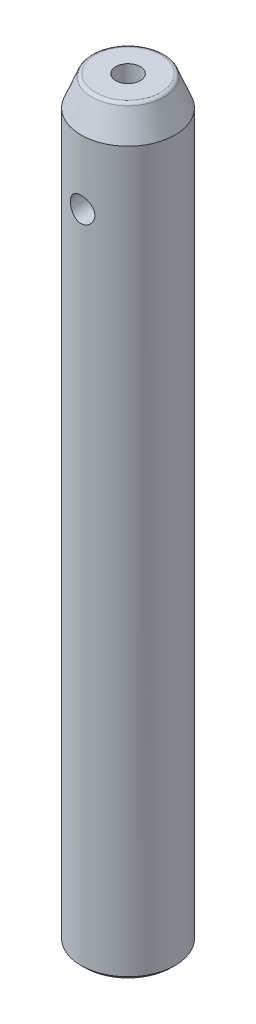
ISO-10303-21;
HEADER;
FILE_DESCRIPTION(('STEP AP214'),'2;1');
FILE_NAME('part.step','',(''),(''),'','','');
FILE_SCHEMA(('AUTOMOTIVE_DESIGN { 1 0 10303 214 1 1 1 1 }'));
ENDSEC;
DATA;
#1=APPLICATION_CONTEXT('core data for automotive mechanical design processes');
#2=APPLICATION_PROTOCOL_DEFINITION('international standard','automotive_design',2000,#1);
#3=PRODUCT_CONTEXT('',#1,'mechanical');
#4=PRODUCT('Part','Part','',(#3));
#5=PRODUCT_RELATED_PRODUCT_CATEGORY('part','',(#4));
#6=PRODUCT_DEFINITION_FORMATION('','',#4);
#7=PRODUCT_DEFINITION_CONTEXT('part definition',#1,'design');
#8=PRODUCT_DEFINITION('design','',#6,#7);
#9=PRODUCT_DEFINITION_SHAPE('','',#8);
#10=(LENGTH_UNIT() NAMED_UNIT(*) SI_UNIT(.MILLI.,.METRE.));
#11=(NAMED_UNIT(*) PLANE_ANGLE_UNIT() SI_UNIT($,.RADIAN.));
#12=(NAMED_UNIT(*) SI_UNIT($,.STERADIAN.) SOLID_ANGLE_UNIT());
#13=UNCERTAINTY_MEASURE_WITH_UNIT(LENGTH_MEASURE(1.E-05),#10,'distance_accuracy_value','');
#14=(GEOMETRIC_REPRESENTATION_CONTEXT(3) GLOBAL_UNCERTAINTY_ASSIGNED_CONTEXT((#13)) GLOBAL_UNIT_ASSIGNED_CONTEXT((#10,
#11,#12)) REPRESENTATION_CONTEXT('',''));
#15=CARTESIAN_POINT('',(0.,0.,0.));
#16=DIRECTION('',(0.,0.,1.));
#17=DIRECTION('',(1.,0.,0.));
#18=AXIS2_PLACEMENT_3D('',#15,#16,#17);
#19=CARTESIAN_POINT('',(0.,11.0000000000241,0.));
#20=DIRECTION('',(0.,-1.,0.));
#21=DIRECTION('',(0.,0.,-1.));
#22=AXIS2_PLACEMENT_3D('',#19,#20,#21);
#23=CONICAL_SURFACE('',#22,2.49999999999773,1.02974425868524);
#24=CARTESIAN_POINT('',(0.,12.5021515474941,-1.13686837721616E-10));
#25=VERTEX_POINT('',#24);
#26=VERTEX_LOOP('',#25);
#27=FACE_BOUND('',#26,.T.);
#28=CARTESIAN_POINT('',(0.,11.,0.));
#29=DIRECTION('',(0.,-1.,0.));
#30=DIRECTION('',(0.,0.,-1.));
#31=AXIS2_PLACEMENT_3D('',#28,#29,#30);
#32=CIRCLE('',#31,2.5);
#33=CARTESIAN_POINT('',(0.,11.,-2.5));
#34=VERTEX_POINT('',#33);
#35=EDGE_CURVE('E33',#34,#34,#32,.T.);
#36=ORIENTED_EDGE('',*,*,#35,.T.);
#37=EDGE_LOOP('',(#36));
#38=FACE_BOUND('',#37,.T.);
#39=ADVANCED_FACE('F17',(#27,#38),#23,.F.);
#40=CARTESIAN_POINT('',(0.,101.6,0.));
#41=DIRECTION('',(0.,1.,0.));
#42=DIRECTION('',(0.,0.,1.));
#43=AXIS2_PLACEMENT_3D('',#40,#41,#42);
#44=CYLINDRICAL_SURFACE('',#43,1.65);
#45=CARTESIAN_POINT('',(0.,101.6,0.));
#46=DIRECTION('',(0.,1.,0.));
#47=DIRECTION('',(0.,0.,1.));
#48=AXIS2_PLACEMENT_3D('',#45,#46,#47);
#49=CIRCLE('',#48,1.65);
#50=CARTESIAN_POINT('',(0.,101.6,1.65));
#51=VERTEX_POINT('',#50);
#52=EDGE_CURVE('E20',#51,#51,#49,.F.);
#53=ORIENTED_EDGE('',*,*,#52,.F.);
#54=EDGE_LOOP('',(#53));
#55=FACE_BOUND('',#54,.T.);
#56=CARTESIAN_POINT('',(0.,91.4999999999964,0.));
#57=DIRECTION('',(0.,1.,0.));
#58=DIRECTION('',(0.,0.,1.));
#59=AXIS2_PLACEMENT_3D('',#56,#57,#58);
#60=CIRCLE('',#59,1.64999999998372);
#61=CARTESIAN_POINT('',(0.,91.4999999999964,1.64999999998372));
#62=VERTEX_POINT('',#61);
#63=EDGE_CURVE('E37',#62,#62,#60,.F.);
#64=ORIENTED_EDGE('',*,*,#63,.T.);
#65=EDGE_LOOP('',(#64));
#66=FACE_BOUND('',#65,.T.);
#67=ADVANCED_FACE('F30',(#55,#66),#44,.F.);
#68=CARTESIAN_POINT('',(0.,0.,0.));
#69=DIRECTION('',(0.,-1.,0.));
#70=DIRECTION('',(0.,0.,-1.));
#71=AXIS2_PLACEMENT_3D('',#68,#69,#70);
#72=CYLINDRICAL_SURFACE('',#71,2.5);
#73=CARTESIAN_POINT('',(0.,0.,0.));
#74=DIRECTION('',(0.,-1.,0.));
#75=DIRECTION('',(0.,0.,-1.));
#76=AXIS2_PLACEMENT_3D('',#73,#74,#75);
#77=CIRCLE('',#76,2.5);
#78=CARTESIAN_POINT('',(0.,0.,-2.5));
#79=VERTEX_POINT('',#78);
#80=EDGE_CURVE('E95',#79,#79,#77,.T.);
#81=ORIENTED_EDGE('',*,*,#80,.T.);
#82=EDGE_LOOP('',(#81));
#83=FACE_BOUND('',#82,.T.);
#84=ORIENTED_EDGE('',*,*,#35,.F.);
#85=EDGE_LOOP('',(#84));
#86=FACE_BOUND('',#85,.T.);
#87=ADVANCED_FACE('F107',(#83,#86),#72,.F.);
#88=CARTESIAN_POINT('',(0.,101.6,0.));
#89=DIRECTION('',(0.,1.,0.));
#90=DIRECTION('',(0.,0.,1.));
#91=AXIS2_PLACEMENT_3D('',#88,#89,#90);
#92=PLANE('',#91);
#93=ORIENTED_EDGE('',*,*,#52,.T.);
#94=EDGE_LOOP('',(#93));
#95=FACE_BOUND('',#94,.T.);
#96=CARTESIAN_POINT('',(0.,101.6,0.));
#97=DIRECTION('',(0.,-1.,0.));
#98=DIRECTION('',(0.,0.,1.));
#99=AXIS2_PLACEMENT_3D('',#96,#97,#98);
#100=CIRCLE('',#99,4.41148351928655);
#101=CARTESIAN_POINT('',(0.,101.6,4.41148351928655));
#102=VERTEX_POINT('',#101);
#103=EDGE_CURVE('E90',#102,#102,#100,.T.);
#104=ORIENTED_EDGE('',*,*,#103,.F.);
#105=EDGE_LOOP('',(#104));
#106=FACE_BOUND('',#105,.T.);
#107=ADVANCED_FACE('F102',(#95,#106),#92,.T.);
#108=CARTESIAN_POINT('',(0.,91.4999999999964,0.));
#109=DIRECTION('',(0.,1.,0.));
#110=DIRECTION('',(0.,0.,1.));
#111=AXIS2_PLACEMENT_3D('',#108,#109,#110);
#112=CONICAL_SURFACE('',#111,1.64999999998372,1.0297442586974);
#113=ORIENTED_EDGE('',*,*,#63,.F.);
#114=EDGE_LOOP('',(#113));
#115=FACE_BOUND('',#114,.T.);
#116=CARTESIAN_POINT('',(-0.0573261511498962,90.5490038545711,-0.0352116028222918));
#117=CARTESIAN_POINT('',(-0.0554022883732764,90.5490707375836,-0.0385561163580597));
#118=CARTESIAN_POINT('',(-0.0531981532231132,90.5491440256648,-0.0417422648619109));
#119=CARTESIAN_POINT('',(-0.0482828474830664,90.5492952426134,-0.0477003560094668));
#120=CARTESIAN_POINT('',(-0.0455711766414923,90.5493731760074,-0.0504718850927817));
#121=CARTESIAN_POINT('',(-0.0397197199490266,90.5495244373034,-0.0555035597035168));
#122=CARTESIAN_POINT('',(-0.0365810372641078,90.549597776384,-0.0577649843052197));
#123=CARTESIAN_POINT('',(-0.0299586933559447,90.5497313166698,-0.0617075438777838));
#124=CARTESIAN_POINT('',(-0.0264751554283292,90.5497915225459,-0.063388885287622));
#125=CARTESIAN_POINT('',(-0.0193829444561787,90.549889833094,-0.0660675180241586));
#126=CARTESIAN_POINT('',(-0.0157819807033844,90.5499285905413,-0.0670852043478714));
#127=CARTESIAN_POINT('',(-0.00845849366103955,90.549982377865,-0.0684855184735178));
#128=CARTESIAN_POINT('',(-0.00473598767196254,90.5499974111034,-0.0688682362592965));
#129=CARTESIAN_POINT('',(0.00263034403320465,90.5500019182519,-0.0689835781676805));
#130=CARTESIAN_POINT('',(0.00627394045520038,90.5499919902664,-0.0687314146979057));
#131=CARTESIAN_POINT('',(0.0134664056954591,90.5499489665894,-0.0676177318612752));
#132=CARTESIAN_POINT('',(0.0170152782107006,90.5499158718034,-0.0667562363122293));
#133=CARTESIAN_POINT('',(0.0239114891588002,90.5498303305145,-0.0644556751879646));
#134=CARTESIAN_POINT('',(0.027259241420805,90.5497779254503,-0.063017845811014));
#135=CARTESIAN_POINT('',(0.0336722325388786,90.5496595047017,-0.0596113616587493));
#136=CARTESIAN_POINT('',(0.0367374494562387,90.5495934879618,-0.0576426657084619));
#137=CARTESIAN_POINT('',(0.0425655657697002,90.5494535010406,-0.0531908473394107));
#138=CARTESIAN_POINT('',(0.0453212204112279,90.5493793985437,-0.0506982522744776));
#139=CARTESIAN_POINT('',(0.0503905841092998,90.5492323170858,-0.045298386908172));
#140=CARTESIAN_POINT('',(0.0527042278189766,90.5491593382923,-0.0423910554029961));
#141=CARTESIAN_POINT('',(0.0569012103209977,90.5490199553575,-0.0361466324427612));
#142=CARTESIAN_POINT('',(0.0587687275516727,90.5489538301732,-0.032798900668456));
#143=CARTESIAN_POINT('',(0.0619336223222681,90.5488379981186,-0.0258437793314458));
#144=CARTESIAN_POINT('',(0.0632309125110924,90.5487882937639,-0.0222363500850218));
#145=CARTESIAN_POINT('',(0.0652553482236291,90.5487094366794,-0.0147526756798051));
#146=CARTESIAN_POINT('',(0.0659649760017658,90.5486809178458,-0.0108716787331461));
#147=CARTESIAN_POINT('',(0.0667340439278036,90.5486499679045,-0.00304555578893097));
#148=CARTESIAN_POINT('',(0.0667934141444053,90.5486475396028,0.000899577060366507));
#149=CARTESIAN_POINT('',(0.0662563777010263,90.5486692108688,0.00880601717822681));
#150=CARTESIAN_POINT('',(0.0656498993612266,90.5486937178683,0.0127666445153317));
#151=CARTESIAN_POINT('',(0.0637790847015403,90.5487671443859,0.0205294397679807));
#152=CARTESIAN_POINT('',(0.0625147342683113,90.5488160644279,0.0243316042821286));
#153=CARTESIAN_POINT('',(0.0593636482967233,90.5489325099744,0.0316538052175982));
#154=CARTESIAN_POINT('',(0.057478989816573,90.5489999732655,0.0351747350933359));
#155=CARTESIAN_POINT('',(0.0531330611081527,90.5491457139666,0.0418408559875551));
#156=CARTESIAN_POINT('',(0.0506718458290167,90.5492239903456,0.0449860827695675));
#157=CARTESIAN_POINT('',(0.0452966678090644,90.5493802673104,0.0507363852339359));
#158=CARTESIAN_POINT('',(0.0423935967096196,90.5494582375324,0.0533516346841233));
#159=CARTESIAN_POINT('',(0.0361768853907724,90.5496062782605,0.0580380482368495));
#160=CARTESIAN_POINT('',(0.0328633252453583,90.5496763503022,0.0601093182081351));
#161=CARTESIAN_POINT('',(0.0260345207144721,90.5497980104141,0.0635776359414988));
#162=CARTESIAN_POINT('',(0.0225292487766217,90.5498501224461,0.06499430150079));
#163=CARTESIAN_POINT('',(0.0153262893794403,90.5499327428712,0.0671998783912845));
#164=CARTESIAN_POINT('',(0.01162863844986,90.5499632553499,0.067988908440471));
#165=CARTESIAN_POINT('',(0.00425845378030556,90.5499985037144,0.0688976252541156));
#166=CARTESIAN_POINT('',(0.000588172158634039,90.5500039448395,0.0690356276725866));
#167=CARTESIAN_POINT('',(-0.00672239125830072,90.549990353846,0.068687324875634));
#168=CARTESIAN_POINT('',(-0.010362675478753,90.5499713237257,0.0682010706376599));
#169=CARTESIAN_POINT('',(-0.0174742174612184,90.5499112663567,0.0666289086995653));
#170=CARTESIAN_POINT('',(-0.0209467584708735,90.5498704511517,0.0655487784540105));
#171=CARTESIAN_POINT('',(-0.027664723580829,90.549771487577,0.0628288651537389));
#172=CARTESIAN_POINT('',(-0.0309101368184019,90.5497133383791,0.0611890553535178));
#173=CARTESIAN_POINT('',(-0.0371317678844729,90.5495851175657,0.0573756078480853));
#174=CARTESIAN_POINT('',(-0.0401036585305885,90.5495148926608,0.0551949234633165));
#175=CARTESIAN_POINT('',(-0.0456522709978388,90.5493706646996,0.0503787184016588));
#176=CARTESIAN_POINT('',(-0.0482289392967434,90.5492966611333,0.0477431362236365));
#177=CARTESIAN_POINT('',(-0.0529952978385418,90.5491504976723,0.042009825513305));
#178=CARTESIAN_POINT('',(-0.0551713882425349,90.5490784558957,0.0389007905286753));
#179=CARTESIAN_POINT('',(-0.0589892048524906,90.5489463103851,0.0323703639447217));
#180=CARTESIAN_POINT('',(-0.0606308683151459,90.5488862080532,0.0289489357298417));
#181=CARTESIAN_POINT('',(-0.0633853477036902,90.5487826626365,0.0217771220498434));
#182=CARTESIAN_POINT('',(-0.0644802191564663,90.5487397928596,0.0180198319928232));
#183=CARTESIAN_POINT('',(-0.0660384140340257,90.5486781191427,0.0103751798101216));
#184=CARTESIAN_POINT('',(-0.0665015009874703,90.5486593242138,0.00648776953904687));
#185=CARTESIAN_POINT('',(-0.0667883152951014,90.5486477323125,-0.00139174105953627));
#186=CARTESIAN_POINT('',(-0.0665985085913375,90.5486554856533,-0.00538433404726781));
#187=CARTESIAN_POINT('',(-0.0655536171892062,90.5486973640983,-0.0132782215506573));
#188=CARTESIAN_POINT('',(-0.0646992929764033,90.5487314590566,-0.0171796151827293));
#189=CARTESIAN_POINT('',(-0.0627577278674121,90.5488062439395,-0.0234565006476819));
#190=CARTESIAN_POINT('',(-0.0618549122133671,90.5488405131456,-0.0258906639126389));
#191=CARTESIAN_POINT('',(-0.0597856555604523,90.5489168418289,-0.0306442674158018));
#192=CARTESIAN_POINT('',(-0.0586192082866899,90.5489589014915,-0.0329637049217327));
#193=CARTESIAN_POINT('',(-0.0573261511498962,90.5490038545711,-0.0352116028222918));
#194=B_SPLINE_CURVE_WITH_KNOTS('',3,(#116,#117,#118,#119,#120,#121,#122,#123,#124,#125,#126,
#127,#128,#129,#130,#131,#132,#133,#134,#135,#136,#137,#138,#139,#140,#141,#142,#143,#144,#145,
#146,#147,#148,#149,#150,#151,#152,#153,#154,#155,#156,#157,#158,#159,#160,#161,#162,#163,#164,
#165,#166,#167,#168,#169,#170,#171,#172,#173,#174,#175,#176,#177,#178,#179,#180,#181,#182,#183,
#184,#185,#186,#187,#188,#189,#190,#191,#192,#193),.UNSPECIFIED.,.T.,.F.,(4,2,2,2,2,2,2,2,2,2,2,
2,2,2,2,2,2,2,2,2,2,2,2,2,2,2,2,2,2,2,2,2,2,2,2,2,2,2,4),(0.,0.0115675319734208,
0.0231465260871456,0.0346961551707873,0.0462416697429212,0.0574131743000647,0.06858309556486,
0.079487933416738,0.0903923450396198,0.101273491514177,0.112155482193047,0.123254403424225,
0.134354964251563,0.145804638511954,0.15725606609736,0.169037677537482,0.180820556006791,
0.192784149640484,0.204747999939958,0.216672190884564,0.228595245848143,0.240261530975984,
0.251925543937648,0.263212780032738,0.274497880626036,0.285463519558364,0.296428263082137,
0.307288177770913,0.318148611497002,0.329158744494119,0.340170367203504,0.351505639903013,
0.362842242917609,0.374529787307456,0.38622170504254,0.398157436467753,0.410079528492371,
0.417854055819345,0.425628768213126),.UNSPECIFIED.);
#195=CARTESIAN_POINT('',(-0.0573261511498962,90.5490038545711,-0.0352116028222918));
#196=VERTEX_POINT('',#195);
#197=EDGE_CURVE('E86',#196,#196,#194,.T.);
#198=ORIENTED_EDGE('',*,*,#197,.T.);
#199=EDGE_LOOP('',(#198));
#200=FACE_BOUND('',#199,.T.);
#201=ADVANCED_FACE('F96',(#115,#200),#112,.F.);
#202=CARTESIAN_POINT('',(0.,0.,0.));
#203=DIRECTION('',(0.,1.,0.));
#204=DIRECTION('',(0.,0.,1.));
#205=AXIS2_PLACEMENT_3D('',#202,#203,#204);
#206=PLANE('',#205);
#207=ORIENTED_EDGE('',*,*,#80,.F.);
#208=EDGE_LOOP('',(#207));
#209=FACE_BOUND('',#208,.T.);
#210=CARTESIAN_POINT('',(0.,-5.6843418860808E-11,0.));
#211=DIRECTION('',(0.,1.,0.));
#212=DIRECTION('',(0.,0.,1.));
#213=AXIS2_PLACEMENT_3D('',#210,#211,#212);
#214=CIRCLE('',#213,5.84999999995262);
#215=CARTESIAN_POINT('',(0.,-5.6843418860808E-11,5.84999999995262));
#216=VERTEX_POINT('',#215);
#217=EDGE_CURVE('E83',#216,#216,#214,.T.);
#218=ORIENTED_EDGE('',*,*,#217,.F.);
#219=EDGE_LOOP('',(#218));
#220=FACE_BOUND('',#219,.T.);
#221=ADVANCED_FACE('F101',(#209,#220),#206,.F.);
#222=CARTESIAN_POINT('',(0.,101.1,0.));
#223=DIRECTION('',(0.,1.,0.));
#224=DIRECTION('',(0.,0.,1.));
#225=AXIS2_PLACEMENT_3D('',#222,#223,#224);
#226=TOROIDAL_SURFACE('',#225,4.41148351928655,0.5);
#227=ORIENTED_EDGE('',*,*,#103,.T.);
#228=EDGE_LOOP('',(#227));
#229=FACE_BOUND('',#228,.T.);
#230=CARTESIAN_POINT('',(0.,101.285695338163,0.));
#231=DIRECTION('',(0.,-1.,0.));
#232=DIRECTION('',(0.,0.,-1.));
#233=AXIS2_PLACEMENT_3D('',#230,#231,#232);
#234=CIRCLE('',#233,4.87572186474949);
#235=CARTESIAN_POINT('',(0.,101.285695338163,-4.87572186474949));
#236=VERTEX_POINT('',#235);
#237=EDGE_CURVE('E85',#236,#236,#234,.T.);
#238=ORIENTED_EDGE('',*,*,#237,.F.);
#239=EDGE_LOOP('',(#238));
#240=FACE_BOUND('',#239,.T.);
#241=ADVANCED_FACE('F76',(#229,#240),#226,.T.);
#242=CARTESIAN_POINT('',(0.,88.9,-6.35));
#243=DIRECTION('',(0.,0.,1.));
#244=DIRECTION('',(1.,0.,0.));
#245=AXIS2_PLACEMENT_3D('',#242,#243,#244);
#246=CYLINDRICAL_SURFACE('',#245,1.65);
#247=CARTESIAN_POINT('',(0.,90.55,-6.35));
#248=CARTESIAN_POINT('',(-0.0910448468003082,90.5499976682171,-6.34999855029433));
#249=CARTESIAN_POINT('',(-0.182115106595806,90.5424390947502,-6.34802256023355));
#250=CARTESIAN_POINT('',(-0.361637722456891,90.512454585361,-6.34033166229604));
#251=CARTESIAN_POINT('',(-0.450088700922076,90.490020966117,-6.33461482219966));
#252=CARTESIAN_POINT('',(-0.621755015806403,90.4310607468939,-6.32007407349407));
#253=CARTESIAN_POINT('',(-0.704976759571175,90.3945518010085,-6.3112540582741));
#254=CARTESIAN_POINT('',(-0.864115385464059,90.3085413495376,-6.29144207556038));
#255=CARTESIAN_POINT('',(-0.940031879382964,90.2590391539967,-6.28044999273518));
#256=CARTESIAN_POINT('',(-1.08408361281692,90.1472915375345,-6.25721162305243));
#257=CARTESIAN_POINT('',(-1.1520343076235,90.0848124948755,-6.2449447581951));
#258=CARTESIAN_POINT('',(-1.27662045234932,89.9493844653781,-6.22067339979481));
#259=CARTESIAN_POINT('',(-1.33325452218134,89.8764342034133,-6.20866893841133));
#260=CARTESIAN_POINT('',(-1.43448627284162,89.7206782133016,-6.18607236088646));
#261=CARTESIAN_POINT('',(-1.47887409675303,89.6377319693092,-6.17550627575628));
#262=CARTESIAN_POINT('',(-1.55300255144221,89.4652354099852,-6.15728432495073));
#263=CARTESIAN_POINT('',(-1.58274573213216,89.375686247472,-6.14962795269175));
#264=CARTESIAN_POINT('',(-1.62610440704154,89.1945636518915,-6.13830437157209));
#265=CARTESIAN_POINT('',(-1.6400533472151,89.1030753126707,-6.13455482406808));
#266=CARTESIAN_POINT('',(-1.65246676688997,88.9189861637562,-6.13122323298144));
#267=CARTESIAN_POINT('',(-1.65093398237216,88.8263855535157,-6.13164045303393));
#268=CARTESIAN_POINT('',(-1.63269273382031,88.6452833269615,-6.13652142945007));
#269=CARTESIAN_POINT('',(-1.61638516940253,88.5567379946043,-6.14087828157327));
#270=CARTESIAN_POINT('',(-1.56969829391199,88.3836852693902,-6.15297677618062));
#271=CARTESIAN_POINT('',(-1.53931790895913,88.2991781852302,-6.16071867697127));
#272=CARTESIAN_POINT('',(-1.46501490019536,88.135543333071,-6.17881066459292));
#273=CARTESIAN_POINT('',(-1.42094967522963,88.0564834562838,-6.18918799570478));
#274=CARTESIAN_POINT('',(-1.32062741969186,87.9067381047646,-6.2113666302963));
#275=CARTESIAN_POINT('',(-1.26436809941903,87.8360542066612,-6.22316820102254));
#276=CARTESIAN_POINT('',(-1.13919365005044,87.7027738510108,-6.2473127089509));
#277=CARTESIAN_POINT('',(-1.06994116814559,87.640494792232,-6.2596611060113));
#278=CARTESIAN_POINT('',(-0.921825284419544,87.5283711559869,-6.28318013507778));
#279=CARTESIAN_POINT('',(-0.842961540881452,87.4785270208217,-6.294350725182));
#280=CARTESIAN_POINT('',(-0.677386395199789,87.3925581170818,-6.31431860148111));
#281=CARTESIAN_POINT('',(-0.590645218331429,87.3564883312651,-6.32310633647018));
#282=CARTESIAN_POINT('',(-0.412050348558329,87.2995330425477,-6.33724917222535));
#283=CARTESIAN_POINT('',(-0.320197718854887,87.2786443945289,-6.34260498396524));
#284=CARTESIAN_POINT('',(-0.136698103214808,87.2531370047135,-6.34917395795849));
#285=CARTESIAN_POINT('',(-0.0451149873460255,87.2480864450094,-6.35049704173526));
#286=CARTESIAN_POINT('',(0.137588879967504,87.253209479221,-6.34916628370758));
#287=CARTESIAN_POINT('',(0.228709675740829,87.2633815847659,-6.34651283070241));
#288=CARTESIAN_POINT('',(0.406378044073725,87.2983062498575,-6.33759791632768));
#289=CARTESIAN_POINT('',(0.492975765461394,87.3228201538139,-6.33139554722162));
#290=CARTESIAN_POINT('',(0.660823076794125,87.385457311397,-6.31608436911728));
#291=CARTESIAN_POINT('',(0.742072101711474,87.4235820001213,-6.30697525364743));
#292=CARTESIAN_POINT('',(0.898610320905379,87.5131743773295,-6.28660102926498));
#293=CARTESIAN_POINT('',(0.973758422974711,87.5648798761606,-6.27529854070212));
#294=CARTESIAN_POINT('',(1.11446374988074,87.6798651154499,-6.25184511462951));
#295=CARTESIAN_POINT('',(1.18001917564773,87.7431470220242,-6.23969401859633));
#296=CARTESIAN_POINT('',(1.30148131934472,87.8814998899548,-6.21551205555071));
#297=CARTESIAN_POINT('',(1.35708406366279,87.9568402624702,-6.20349303878838));
#298=CARTESIAN_POINT('',(1.45486120763641,88.1160338615831,-6.18129455708219));
#299=CARTESIAN_POINT('',(1.49703618671815,88.1998867206493,-6.17111501277082));
#300=CARTESIAN_POINT('',(1.56644342790352,88.3732909662336,-6.1538633886004));
#301=CARTESIAN_POINT('',(1.59376344846782,88.4628053190823,-6.14677310890371));
#302=CARTESIAN_POINT('',(1.63290364352222,88.6453713800005,-6.13649272367049));
#303=CARTESIAN_POINT('',(1.64472753735072,88.7384222337294,-6.13330168226177));
#304=CARTESIAN_POINT('',(1.65233394666402,88.9223158530834,-6.13125643136561));
#305=CARTESIAN_POINT('',(1.64860385935213,89.0131373030377,-6.13227044727086));
#306=CARTESIAN_POINT('',(1.62633248920675,89.1928083988953,-6.13821413746059));
#307=CARTESIAN_POINT('',(1.60779155168882,89.2816580907206,-6.14314372045345));
#308=CARTESIAN_POINT('',(1.55670066869661,89.4542849336611,-6.15628671879343));
#309=CARTESIAN_POINT('',(1.52424906376861,89.5380930694244,-6.16447705404005));
#310=CARTESIAN_POINT('',(1.44633487299294,89.6991372793875,-6.18322034588069));
#311=CARTESIAN_POINT('',(1.40087034238606,89.7763723690169,-6.1937736555658));
#312=CARTESIAN_POINT('',(1.2967225755824,89.9244165987663,-6.2164235298058));
#313=CARTESIAN_POINT('',(1.23770439442365,89.9949847909385,-6.22855507321492));
#314=CARTESIAN_POINT('',(1.10876820201018,90.1253743094952,-6.25279366601997));
#315=CARTESIAN_POINT('',(1.03884757177489,90.1851930461999,-6.26490070882064));
#316=CARTESIAN_POINT('',(0.888403621483176,90.2935578156403,-6.28801547883296));
#317=CARTESIAN_POINT('',(0.80769621722341,90.3418544691496,-6.29899637718776));
#318=CARTESIAN_POINT('',(0.639026945353667,90.4241179017623,-6.31833266373967));
#319=CARTESIAN_POINT('',(0.551070009182764,90.4580943274653,-6.32668981840985));
#320=CARTESIAN_POINT('',(0.386139089142769,90.5060647536217,-6.33869137211507));
#321=CARTESIAN_POINT('',(0.309908192256337,90.5225033267601,-6.3429019511159));
#322=CARTESIAN_POINT('',(0.155790967896648,90.5444714653745,-6.34855676301915));
#323=CARTESIAN_POINT('',(0.0779047873851499,90.550001995248,-6.35000124047671));
#324=CARTESIAN_POINT('',(0.,90.55,-6.35));
#325=B_SPLINE_CURVE_WITH_KNOTS('',3,(#247,#248,#249,#250,#251,#252,#253,#254,#255,#256,#257,
#258,#259,#260,#261,#262,#263,#264,#265,#266,#267,#268,#269,#270,#271,#272,#273,#274,#275,#276,
#277,#278,#279,#280,#281,#282,#283,#284,#285,#286,#287,#288,#289,#290,#291,#292,#293,#294,#295,
#296,#297,#298,#299,#300,#301,#302,#303,#304,#305,#306,#307,#308,#309,#310,#311,#312,#313,#314,
#315,#316,#317,#318,#319,#320,#321,#322,#323,#324),.UNSPECIFIED.,.T.,.F.,(4,2,2,2,2,2,2,2,2,2,2,
2,2,2,2,2,2,2,2,2,2,2,2,2,2,2,2,2,2,2,2,2,2,2,2,2,2,2,4),(0.,0.272848929366457,
0.545838901719087,0.818487582289903,1.09115074372664,1.36923066335056,1.64734447476101,
1.92996381752703,2.2125339334486,2.48902023778602,2.76545768141706,3.03461179177955,
3.30378644435438,3.57586585501713,3.847996398704,4.12853593267049,4.4090854437959,
4.69074339517815,4.97234297805997,5.24619498691974,5.52002022210175,5.7894134798494,
6.05883515035252,6.33333182956842,6.60787992378508,6.88975050237246,7.17160891621466,
7.45178358912652,7.73189100294895,8.00328805481912,8.27467877924091,8.54418177129595,
8.81372506115524,9.09082731912148,9.36799624528849,9.65070850236322,9.93323000913878,
10.1667206253154,10.4001905972863),.UNSPECIFIED.);
#326=CARTESIAN_POINT('',(0.,90.55,-6.35));
#327=VERTEX_POINT('',#326);
#328=EDGE_CURVE('E53',#327,#327,#325,.T.);
#329=ORIENTED_EDGE('',*,*,#328,.F.);
#330=EDGE_LOOP('',(#329));
#331=FACE_BOUND('',#330,.T.);
#332=CARTESIAN_POINT('',(1.65,88.9,6.13188388670236));
#333=CARTESIAN_POINT('',(1.64999763632435,88.8090136721729,6.13188553974096));
#334=CARTESIAN_POINT('',(1.64244844153519,88.7180018674392,6.1339311300214));
#335=CARTESIAN_POINT('',(1.61250455514409,88.5386004900151,6.14186949481345));
#336=CARTESIAN_POINT('',(1.5901019220464,88.4502123465098,6.14776432732408));
#337=CARTESIAN_POINT('',(1.53123224488278,88.2786793338544,6.16268948392982));
#338=CARTESIAN_POINT('',(1.49478429898853,88.1955275224345,6.17171554866363));
#339=CARTESIAN_POINT('',(1.40891777621458,88.0365074719336,6.19188078325927));
#340=CARTESIAN_POINT('',(1.35949838016074,87.960639693268,6.20302008656419));
#341=CARTESIAN_POINT('',(1.24783688885236,87.81653888418,6.22645310825879));
#342=CARTESIAN_POINT('',(1.18534252309153,87.7485044869894,6.23876646120304));
#343=CARTESIAN_POINT('',(1.04984797263574,87.6237551133751,6.26299035325661));
#344=CARTESIAN_POINT('',(0.976846745509041,87.5670412614466,6.27490085225206));
#345=CARTESIAN_POINT('',(0.821040256319288,87.4657210900175,6.29719537033068));
#346=CARTESIAN_POINT('',(0.738103189338849,87.4213112699395,6.30755352225317));
#347=CARTESIAN_POINT('',(0.565626227797421,87.3471396857437,6.3253515123212));
#348=CARTESIAN_POINT('',(0.476087390988534,87.3173755808916,6.33279181676967));
#349=CARTESIAN_POINT('',(0.295020848099705,87.2739804221676,6.34377696958343));
#350=CARTESIAN_POINT('',(0.203579090054266,87.2600117165979,6.34740322613677));
#351=CARTESIAN_POINT('',(0.0195829629697998,87.2475425816485,6.35063594138407));
#352=CARTESIAN_POINT('',(-0.072971226559901,87.2490396892051,6.35024304016357));
#353=CARTESIAN_POINT('',(-0.254218250184158,87.2672197932799,6.34554175382561));
#354=CARTESIAN_POINT('',(-0.342950470718923,87.2835381302079,6.34132739539431));
#355=CARTESIAN_POINT('',(-0.516371169852848,87.3303095949893,6.32956706077998));
#356=CARTESIAN_POINT('',(-0.601059423668865,87.3607635075599,6.32202089963765));
#357=CARTESIAN_POINT('',(-0.764931511252363,87.4352275832225,6.30430356599421));
#358=CARTESIAN_POINT('',(-0.84405490930899,87.4793646946024,6.29410796246699));
#359=CARTESIAN_POINT('',(-0.993897831944063,87.579845323999,6.27219339176724));
#360=CARTESIAN_POINT('',(-1.0646157870859,87.6361911160533,6.26047414095694));
#361=CARTESIAN_POINT('',(-1.1978163351087,87.7614334490824,6.23638166643451));
#362=CARTESIAN_POINT('',(-1.25999831770284,87.830648309973,6.22399933862567));
#363=CARTESIAN_POINT('',(-1.37194316665815,87.9786523096785,6.20028671836818));
#364=CARTESIAN_POINT('',(-1.42170535261384,88.0574419726875,6.1889564835787));
#365=CARTESIAN_POINT('',(-1.50761156967559,88.222984859806,6.16859596556769));
#366=CARTESIAN_POINT('',(-1.54367780672265,88.3097801949515,6.15957891257177));
#367=CARTESIAN_POINT('',(-1.60061006098444,88.4884943899756,6.14503216732012));
#368=CARTESIAN_POINT('',(-1.62147963009722,88.58041204721,6.139501660199));
#369=CARTESIAN_POINT('',(-1.64691605317234,88.7639600951148,6.13272673240101));
#370=CARTESIAN_POINT('',(-1.65192968322157,88.8555243073088,6.13136488687884));
#371=CARTESIAN_POINT('',(-1.6467396114869,89.0381820664328,6.13276088410879));
#372=CARTESIAN_POINT('',(-1.63653743698053,89.12927565968,6.13551831339115));
#373=CARTESIAN_POINT('',(-1.60159835751182,89.3067111032332,6.14472911696835));
#374=CARTESIAN_POINT('',(-1.57712648589762,89.3931089807301,6.15111504469164));
#375=CARTESIAN_POINT('',(-1.51463894373683,89.5605749139209,6.16679819321596));
#376=CARTESIAN_POINT('',(-1.47662157165586,89.6416422985022,6.17609577975075));
#377=CARTESIAN_POINT('',(-1.38720350487009,89.7980251849691,6.19679824352577));
#378=CARTESIAN_POINT('',(-1.33553846790759,89.8731841014284,6.20824328210405));
#379=CARTESIAN_POINT('',(-1.22062204687913,90.0139295571017,6.23185492577481));
#380=CARTESIAN_POINT('',(-1.15736859903679,90.0795143875257,6.24402165913228));
#381=CARTESIAN_POINT('',(-1.01901104089211,90.2010858779192,6.26810744462941));
#382=CARTESIAN_POINT('',(-0.94363079191536,90.2567620081884,6.28001069362144));
#383=CARTESIAN_POINT('',(-0.784333377232104,90.3546682026395,6.3018866129425));
#384=CARTESIAN_POINT('',(-0.700416664129455,90.3968989792051,6.31185938554421));
#385=CARTESIAN_POINT('',(-0.527016611327769,90.4663359250745,6.3286868090298));
#386=CARTESIAN_POINT('',(-0.437579952622007,90.4936528480859,6.33556437657373));
#387=CARTESIAN_POINT('',(-0.255181418968207,90.5328129713154,6.34552712562432));
#388=CARTESIAN_POINT('',(-0.162220287138941,90.5446594149465,6.34861310203662));
#389=CARTESIAN_POINT('',(0.0216806405938925,90.5523476975197,6.35060954213632));
#390=CARTESIAN_POINT('',(0.112600330589225,90.548646169765,6.34963914291606));
#391=CARTESIAN_POINT('',(0.292475723160698,90.526397859056,6.34389911049899));
#392=CARTESIAN_POINT('',(0.381431492826536,90.5078515840235,6.33912960729081));
#393=CARTESIAN_POINT('',(0.554334249605653,90.4566930536534,6.32634877587924));
#394=CARTESIAN_POINT('',(0.638309022049665,90.4241692711005,6.31835785750941));
#395=CARTESIAN_POINT('',(0.799657538098559,90.3460583586729,6.29997214989296));
#396=CARTESIAN_POINT('',(0.877030391538021,90.300469470774,6.2895770371773));
#397=CARTESIAN_POINT('',(1.02512119470898,90.1961626073455,6.26716709585033));
#398=CARTESIAN_POINT('',(1.09561856239325,90.1371389033826,6.25511766534273));
#399=CARTESIAN_POINT('',(1.22586275551582,90.0082234335704,6.23090349817102));
#400=CARTESIAN_POINT('',(1.28560679239571,89.9383288574161,6.21873873245658));
#401=CARTESIAN_POINT('',(1.39386165712694,89.7879245968643,6.19538429010402));
#402=CARTESIAN_POINT('',(1.44211599306215,89.7072260515196,6.18421983395787));
#403=CARTESIAN_POINT('',(1.52430254643321,89.5385820488824,6.16447892641519));
#404=CARTESIAN_POINT('',(1.55824457593226,89.450641606005,6.15590070313312));
#405=CARTESIAN_POINT('',(1.60614388011357,89.2857937772314,6.14355741275248));
#406=CARTESIAN_POINT('',(1.62255248361923,89.2096329869087,6.13921421063347));
#407=CARTESIAN_POINT('',(1.64448100300523,89.0556542335596,6.13337688486827));
#408=CARTESIAN_POINT('',(1.6500020220631,88.9778364392358,6.13188247257078));
#409=CARTESIAN_POINT('',(1.65,88.9,6.13188388670236));
#410=B_SPLINE_CURVE_WITH_KNOTS('',3,(#332,#333,#334,#335,#336,#337,#338,#339,#340,#341,#342,
#343,#344,#345,#346,#347,#348,#349,#350,#351,#352,#353,#354,#355,#356,#357,#358,#359,#360,#361,
#362,#363,#364,#365,#366,#367,#368,#369,#370,#371,#372,#373,#374,#375,#376,#377,#378,#379,#380,
#381,#382,#383,#384,#385,#386,#387,#388,#389,#390,#391,#392,#393,#394,#395,#396,#397,#398,#399,
#400,#401,#402,#403,#404,#405,#406,#407,#408,#409),.UNSPECIFIED.,.T.,.F.,(4,2,2,2,2,2,2,2,2,2,2,
2,2,2,2,2,2,2,2,2,2,2,2,2,2,2,2,2,2,2,2,2,2,2,2,2,2,2,4),(0.,0.272672926683555,
0.545491757562697,0.817940923503109,1.09040729931826,1.36871710122713,1.64705453452927,
1.92960985094952,2.21211999361815,2.48846958169581,2.76477515940421,3.03446142923301,
3.30416267211511,3.57644504089438,3.84877816974043,4.12905991840252,4.40935701863624,
4.69122322600103,4.97302353196756,5.24680930902984,5.52056760685324,5.78939636875262,
6.05825891181398,6.33276889460923,6.6073278124053,6.8893742695343,7.17140578032909,
7.45131334025019,7.73116220763909,8.00285046042542,8.2745294176336,8.5445134987058,
8.81453392556817,9.09145439408535,9.36844657060043,9.65113942210741,9.93363815202068,
10.1669263945671,10.400190998117),.UNSPECIFIED.);
#411=CARTESIAN_POINT('',(1.65,88.9,6.13188388670236));
#412=VERTEX_POINT('',#411);
#413=EDGE_CURVE('E46',#412,#412,#410,.T.);
#414=ORIENTED_EDGE('',*,*,#413,.F.);
#415=EDGE_LOOP('',(#414));
#416=FACE_BOUND('',#415,.T.);
#417=ORIENTED_EDGE('',*,*,#197,.F.);
#418=EDGE_LOOP('',(#417));
#419=FACE_BOUND('',#418,.T.);
#420=ADVANCED_FACE('F57',(#331,#416,#419),#246,.F.);
#421=CARTESIAN_POINT('',(0.,0.499999999931333,0.));
#422=DIRECTION('',(0.,1.,0.));
#423=DIRECTION('',(0.,0.,1.));
#424=AXIS2_PLACEMENT_3D('',#421,#422,#423);
#425=CONICAL_SURFACE('',#424,6.34999999999764,0.785398163454292);
#426=CARTESIAN_POINT('',(0.,0.5,0.));
#427=DIRECTION('',(0.,-1.,0.));
#428=DIRECTION('',(0.,0.,-1.));
#429=AXIS2_PLACEMENT_3D('',#426,#427,#428);
#430=CIRCLE('',#429,6.35);
#431=CARTESIAN_POINT('',(0.,0.5,-6.35));
#432=VERTEX_POINT('',#431);
#433=EDGE_CURVE('E24',#432,#432,#430,.F.);
#434=ORIENTED_EDGE('',*,*,#433,.F.);
#435=EDGE_LOOP('',(#434));
#436=FACE_BOUND('',#435,.T.);
#437=ORIENTED_EDGE('',*,*,#217,.T.);
#438=EDGE_LOOP('',(#437));
#439=FACE_BOUND('',#438,.T.);
#440=ADVANCED_FACE('F68',(#436,#439),#425,.T.);
#441=CARTESIAN_POINT('',(0.,97.5999999999999,0.));
#442=DIRECTION('',(0.,-1.,0.));
#443=DIRECTION('',(0.,0.,-1.));
#444=AXIS2_PLACEMENT_3D('',#441,#442,#443);
#445=CONICAL_SURFACE('',#444,6.35000000002606,0.380506377115024);
#446=CARTESIAN_POINT('',(0.,97.6,0.));
#447=DIRECTION('',(0.,-1.,0.));
#448=DIRECTION('',(0.,0.,-1.));
#449=AXIS2_PLACEMENT_3D('',#446,#447,#448);
#450=CIRCLE('',#449,6.35);
#451=CARTESIAN_POINT('',(0.,97.6,-6.35));
#452=VERTEX_POINT('',#451);
#453=EDGE_CURVE('E10',#452,#452,#450,.T.);
#454=ORIENTED_EDGE('',*,*,#453,.F.);
#455=EDGE_LOOP('',(#454));
#456=FACE_BOUND('',#455,.T.);
#457=ORIENTED_EDGE('',*,*,#237,.T.);
#458=EDGE_LOOP('',(#457));
#459=FACE_BOUND('',#458,.T.);
#460=ADVANCED_FACE('F64',(#456,#459),#445,.T.);
#461=CARTESIAN_POINT('',(0.,101.6,0.));
#462=DIRECTION('',(0.,-1.,0.));
#463=DIRECTION('',(0.,0.,-1.));
#464=AXIS2_PLACEMENT_3D('',#461,#462,#463);
#465=CYLINDRICAL_SURFACE('',#464,6.35);
#466=ORIENTED_EDGE('',*,*,#453,.T.);
#467=EDGE_LOOP('',(#466));
#468=FACE_BOUND('',#467,.T.);
#469=ORIENTED_EDGE('',*,*,#433,.T.);
#470=EDGE_LOOP('',(#469));
#471=FACE_BOUND('',#470,.T.);
#472=ORIENTED_EDGE('',*,*,#413,.T.);
#473=EDGE_LOOP('',(#472));
#474=FACE_BOUND('',#473,.T.);
#475=ORIENTED_EDGE('',*,*,#328,.T.);
#476=EDGE_LOOP('',(#475));
#477=FACE_BOUND('',#476,.T.);
#478=ADVANCED_FACE('F60',(#468,#471,#474,#477),#465,.T.);
#479=CLOSED_SHELL('',(#39,#67,#87,#107,#201,#221,#241,#420,#440,#460,#478));
#480=MANIFOLD_SOLID_BREP('B1',#479);
#481=ADVANCED_BREP_SHAPE_REPRESENTATION('',(#18,#480),#14);
#482=SHAPE_DEFINITION_REPRESENTATION(#9,#481);
ENDSEC;
END-ISO-10303-21;
